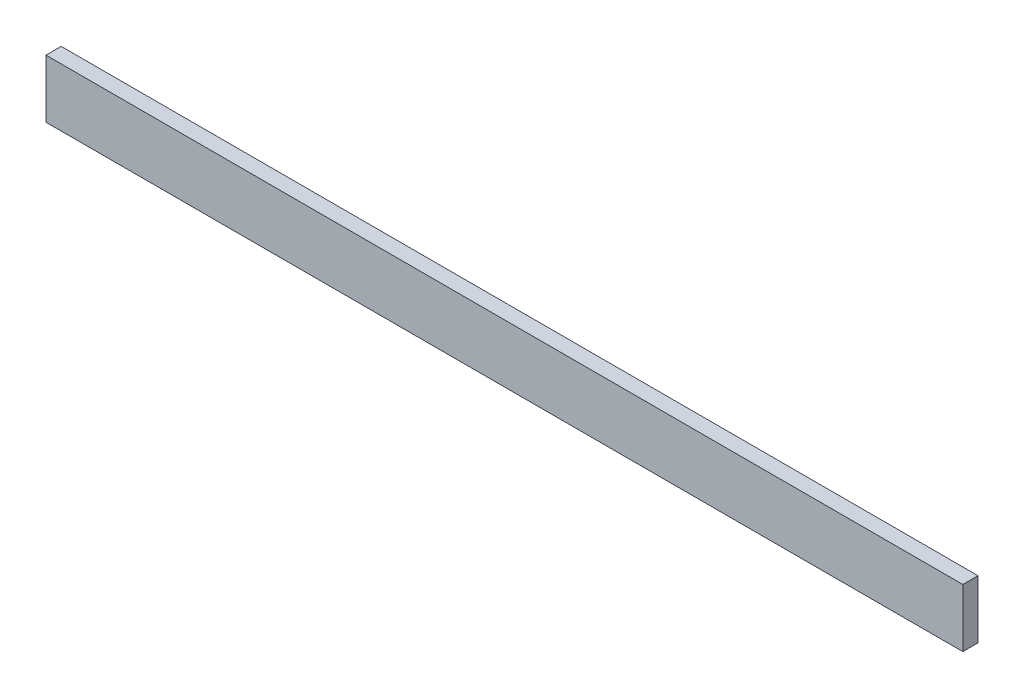
ISO-10303-21;
HEADER;
FILE_DESCRIPTION(('STEP AP214'),'2;1');
FILE_NAME('part.step','',(''),(''),'','','');
FILE_SCHEMA(('AUTOMOTIVE_DESIGN { 1 0 10303 214 1 1 1 1 }'));
ENDSEC;
DATA;
#1=APPLICATION_CONTEXT('core data for automotive mechanical design processes');
#2=APPLICATION_PROTOCOL_DEFINITION('international standard','automotive_design',2000,#1);
#3=PRODUCT_CONTEXT('',#1,'mechanical');
#4=PRODUCT('Part','Part','',(#3));
#5=PRODUCT_RELATED_PRODUCT_CATEGORY('part','',(#4));
#6=PRODUCT_DEFINITION_FORMATION('','',#4);
#7=PRODUCT_DEFINITION_CONTEXT('part definition',#1,'design');
#8=PRODUCT_DEFINITION('design','',#6,#7);
#9=PRODUCT_DEFINITION_SHAPE('','',#8);
#10=(LENGTH_UNIT() NAMED_UNIT(*) SI_UNIT(.MILLI.,.METRE.));
#11=(NAMED_UNIT(*) PLANE_ANGLE_UNIT() SI_UNIT($,.RADIAN.));
#12=(NAMED_UNIT(*) SI_UNIT($,.STERADIAN.) SOLID_ANGLE_UNIT());
#13=UNCERTAINTY_MEASURE_WITH_UNIT(LENGTH_MEASURE(1.E-05),#10,'distance_accuracy_value','');
#14=(GEOMETRIC_REPRESENTATION_CONTEXT(3) GLOBAL_UNCERTAINTY_ASSIGNED_CONTEXT((#13)) GLOBAL_UNIT_ASSIGNED_CONTEXT((#10,
#11,#12)) REPRESENTATION_CONTEXT('',''));
#15=CARTESIAN_POINT('',(0.,0.,0.));
#16=DIRECTION('',(0.,0.,1.));
#17=DIRECTION('',(1.,0.,0.));
#18=AXIS2_PLACEMENT_3D('',#15,#16,#17);
#19=CARTESIAN_POINT('',(0.,38.2926221353073,10.));
#20=DIRECTION('',(1.,0.,0.));
#21=DIRECTION('',(0.,0.,-1.));
#22=AXIS2_PLACEMENT_3D('',#19,#20,#21);
#23=PLANE('',#22);
#24=DIRECTION('',(0.,-1.,0.));
#25=VECTOR('',#24,1.);
#26=CARTESIAN_POINT('',(0.,38.2926221353073,0.));
#27=LINE('',#26,#25);
#28=CARTESIAN_POINT('',(0.,38.2926221353073,0.));
#29=VERTEX_POINT('',#28);
#30=CARTESIAN_POINT('',(0.,0.,0.));
#31=VERTEX_POINT('',#30);
#32=EDGE_CURVE('E113',#29,#31,#27,.T.);
#33=ORIENTED_EDGE('',*,*,#32,.T.);
#34=DIRECTION('',(0.,0.,-1.));
#35=VECTOR('',#34,1.);
#36=CARTESIAN_POINT('',(0.,0.,10.));
#37=LINE('',#36,#35);
#38=CARTESIAN_POINT('',(0.,0.,10.));
#39=VERTEX_POINT('',#38);
#40=EDGE_CURVE('E11',#39,#31,#37,.T.);
#41=ORIENTED_EDGE('',*,*,#40,.F.);
#42=DIRECTION('',(0.,-1.,0.));
#43=VECTOR('',#42,1.);
#44=CARTESIAN_POINT('',(0.,38.2926221353073,10.));
#45=LINE('',#44,#43);
#46=CARTESIAN_POINT('',(0.,38.2926221353073,10.));
#47=VERTEX_POINT('',#46);
#48=EDGE_CURVE('E97',#47,#39,#45,.T.);
#49=ORIENTED_EDGE('',*,*,#48,.F.);
#50=DIRECTION('',(0.,0.,-1.));
#51=VECTOR('',#50,1.);
#52=CARTESIAN_POINT('',(0.,38.2926221353073,10.));
#53=LINE('',#52,#51);
#54=EDGE_CURVE('E109',#47,#29,#53,.T.);
#55=ORIENTED_EDGE('',*,*,#54,.T.);
#56=EDGE_LOOP('',(#33,#41,#49,#55));
#57=FACE_BOUND('',#56,.T.);
#58=ADVANCED_FACE('F45',(#57),#23,.F.);
#59=CARTESIAN_POINT('',(0.,0.,10.));
#60=DIRECTION('',(0.,1.,0.));
#61=DIRECTION('',(0.,0.,1.));
#62=AXIS2_PLACEMENT_3D('',#59,#60,#61);
#63=PLANE('',#62);
#64=DIRECTION('',(1.,0.,0.));
#65=VECTOR('',#64,1.);
#66=CARTESIAN_POINT('',(0.,0.,0.));
#67=LINE('',#66,#65);
#68=CARTESIAN_POINT('',(603.64168744662,0.,0.));
#69=VERTEX_POINT('',#68);
#70=EDGE_CURVE('E102',#31,#69,#67,.T.);
#71=ORIENTED_EDGE('',*,*,#70,.T.);
#72=DIRECTION('',(0.,0.,-1.));
#73=VECTOR('',#72,1.);
#74=CARTESIAN_POINT('',(603.64168744662,0.,10.));
#75=LINE('',#74,#73);
#76=CARTESIAN_POINT('',(603.64168744662,0.,10.));
#77=VERTEX_POINT('',#76);
#78=EDGE_CURVE('E54',#77,#69,#75,.T.);
#79=ORIENTED_EDGE('',*,*,#78,.F.);
#80=DIRECTION('',(1.,0.,0.));
#81=VECTOR('',#80,1.);
#82=CARTESIAN_POINT('',(0.,0.,10.));
#83=LINE('',#82,#81);
#84=EDGE_CURVE('E92',#39,#77,#83,.T.);
#85=ORIENTED_EDGE('',*,*,#84,.F.);
#86=ORIENTED_EDGE('',*,*,#40,.T.);
#87=EDGE_LOOP('',(#71,#79,#85,#86));
#88=FACE_BOUND('',#87,.T.);
#89=ADVANCED_FACE('F101',(#88),#63,.F.);
#90=CARTESIAN_POINT('',(603.64168744662,0.,10.));
#91=DIRECTION('',(-1.,0.,0.));
#92=DIRECTION('',(0.,0.,1.));
#93=AXIS2_PLACEMENT_3D('',#90,#91,#92);
#94=PLANE('',#93);
#95=DIRECTION('',(0.,1.,0.));
#96=VECTOR('',#95,1.);
#97=CARTESIAN_POINT('',(603.64168744662,0.,0.));
#98=LINE('',#97,#96);
#99=CARTESIAN_POINT('',(603.64168744662,38.2926221353073,0.));
#100=VERTEX_POINT('',#99);
#101=EDGE_CURVE('E79',#69,#100,#98,.T.);
#102=ORIENTED_EDGE('',*,*,#101,.T.);
#103=DIRECTION('',(0.,0.,-1.));
#104=VECTOR('',#103,1.);
#105=CARTESIAN_POINT('',(603.64168744662,38.2926221353073,10.));
#106=LINE('',#105,#104);
#107=CARTESIAN_POINT('',(603.64168744662,38.2926221353073,10.));
#108=VERTEX_POINT('',#107);
#109=EDGE_CURVE('E104',#108,#100,#106,.T.);
#110=ORIENTED_EDGE('',*,*,#109,.F.);
#111=DIRECTION('',(0.,1.,0.));
#112=VECTOR('',#111,1.);
#113=CARTESIAN_POINT('',(603.64168744662,0.,10.));
#114=LINE('',#113,#112);
#115=EDGE_CURVE('E95',#77,#108,#114,.T.);
#116=ORIENTED_EDGE('',*,*,#115,.F.);
#117=ORIENTED_EDGE('',*,*,#78,.T.);
#118=EDGE_LOOP('',(#102,#110,#116,#117));
#119=FACE_BOUND('',#118,.T.);
#120=ADVANCED_FACE('F105',(#119),#94,.F.);
#121=CARTESIAN_POINT('',(603.64168744662,38.2926221353073,10.));
#122=DIRECTION('',(0.,-1.,0.));
#123=DIRECTION('',(0.,0.,-1.));
#124=AXIS2_PLACEMENT_3D('',#121,#122,#123);
#125=PLANE('',#124);
#126=DIRECTION('',(-1.,0.,0.));
#127=VECTOR('',#126,1.);
#128=CARTESIAN_POINT('',(603.64168744662,38.2926221353073,0.));
#129=LINE('',#128,#127);
#130=EDGE_CURVE('E85',#100,#29,#129,.T.);
#131=ORIENTED_EDGE('',*,*,#130,.T.);
#132=ORIENTED_EDGE('',*,*,#54,.F.);
#133=DIRECTION('',(-1.,0.,0.));
#134=VECTOR('',#133,1.);
#135=CARTESIAN_POINT('',(603.64168744662,38.2926221353073,10.));
#136=LINE('',#135,#134);
#137=EDGE_CURVE('E62',#108,#47,#136,.T.);
#138=ORIENTED_EDGE('',*,*,#137,.F.);
#139=ORIENTED_EDGE('',*,*,#109,.T.);
#140=EDGE_LOOP('',(#131,#132,#138,#139));
#141=FACE_BOUND('',#140,.T.);
#142=ADVANCED_FACE('F126',(#141),#125,.F.);
#143=CARTESIAN_POINT('',(0.,0.,10.));
#144=DIRECTION('',(0.,0.,1.));
#145=DIRECTION('',(1.,0.,0.));
#146=AXIS2_PLACEMENT_3D('',#143,#144,#145);
#147=PLANE('',#146);
#148=ORIENTED_EDGE('',*,*,#48,.T.);
#149=ORIENTED_EDGE('',*,*,#84,.T.);
#150=ORIENTED_EDGE('',*,*,#115,.T.);
#151=ORIENTED_EDGE('',*,*,#137,.T.);
#152=EDGE_LOOP('',(#148,#149,#150,#151));
#153=FACE_BOUND('',#152,.T.);
#154=ADVANCED_FACE('F93',(#153),#147,.T.);
#155=CARTESIAN_POINT('',(0.,0.,0.));
#156=DIRECTION('',(0.,0.,1.));
#157=DIRECTION('',(1.,0.,0.));
#158=AXIS2_PLACEMENT_3D('',#155,#156,#157);
#159=PLANE('',#158);
#160=ORIENTED_EDGE('',*,*,#32,.F.);
#161=ORIENTED_EDGE('',*,*,#130,.F.);
#162=ORIENTED_EDGE('',*,*,#101,.F.);
#163=ORIENTED_EDGE('',*,*,#70,.F.);
#164=EDGE_LOOP('',(#160,#161,#162,#163));
#165=FACE_BOUND('',#164,.T.);
#166=ADVANCED_FACE('F129',(#165),#159,.F.);
#167=CLOSED_SHELL('',(#58,#89,#120,#142,#154,#166));
#168=MANIFOLD_SOLID_BREP('B2',#167);
#169=ADVANCED_BREP_SHAPE_REPRESENTATION('',(#18,#168),#14);
#170=SHAPE_DEFINITION_REPRESENTATION(#9,#169);
ENDSEC;
END-ISO-10303-21;
